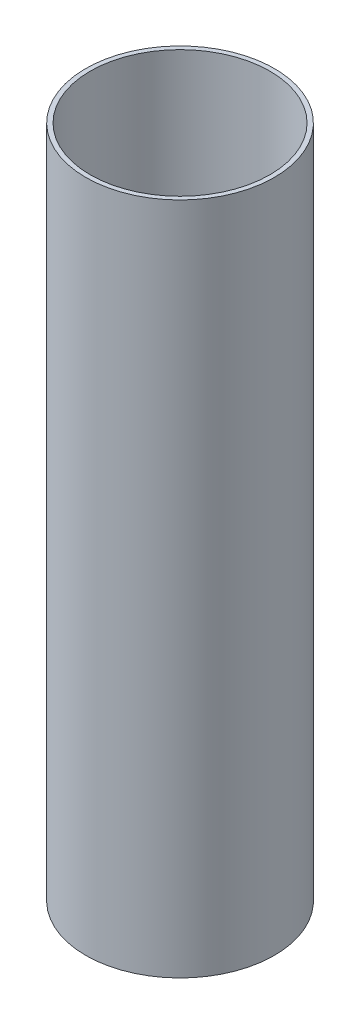
ISO-10303-21;
HEADER;
FILE_DESCRIPTION(('STEP AP214'),'2;1');
FILE_NAME('part.step','',(''),(''),'','','');
FILE_SCHEMA(('AUTOMOTIVE_DESIGN { 1 0 10303 214 1 1 1 1 }'));
ENDSEC;
DATA;
#1=APPLICATION_CONTEXT('core data for automotive mechanical design processes');
#2=APPLICATION_PROTOCOL_DEFINITION('international standard','automotive_design',2000,#1);
#3=PRODUCT_CONTEXT('',#1,'mechanical');
#4=PRODUCT('Part','Part','',(#3));
#5=PRODUCT_RELATED_PRODUCT_CATEGORY('part','',(#4));
#6=PRODUCT_DEFINITION_FORMATION('','',#4);
#7=PRODUCT_DEFINITION_CONTEXT('part definition',#1,'design');
#8=PRODUCT_DEFINITION('design','',#6,#7);
#9=PRODUCT_DEFINITION_SHAPE('','',#8);
#10=(LENGTH_UNIT() NAMED_UNIT(*) SI_UNIT(.MILLI.,.METRE.));
#11=(NAMED_UNIT(*) PLANE_ANGLE_UNIT() SI_UNIT($,.RADIAN.));
#12=(NAMED_UNIT(*) SI_UNIT($,.STERADIAN.) SOLID_ANGLE_UNIT());
#13=UNCERTAINTY_MEASURE_WITH_UNIT(LENGTH_MEASURE(1.E-05),#10,'distance_accuracy_value','');
#14=(GEOMETRIC_REPRESENTATION_CONTEXT(3) GLOBAL_UNCERTAINTY_ASSIGNED_CONTEXT((#13)) GLOBAL_UNIT_ASSIGNED_CONTEXT((#10,
#11,#12)) REPRESENTATION_CONTEXT('',''));
#15=CARTESIAN_POINT('',(0.,0.,0.));
#16=DIRECTION('',(0.,0.,1.));
#17=DIRECTION('',(1.,0.,0.));
#18=AXIS2_PLACEMENT_3D('',#15,#16,#17);
#19=CARTESIAN_POINT('',(0.,285.75,0.));
#20=DIRECTION('',(0.,1.,0.));
#21=DIRECTION('',(0.,0.,1.));
#22=AXIS2_PLACEMENT_3D('',#19,#20,#21);
#23=PLANE('',#22);
#24=CARTESIAN_POINT('',(0.,285.75,0.));
#25=DIRECTION('',(0.,1.,0.));
#26=DIRECTION('',(0.,0.,1.));
#27=AXIS2_PLACEMENT_3D('',#24,#25,#26);
#28=CIRCLE('',#27,40.005);
#29=CARTESIAN_POINT('',(0.,285.75,40.005));
#30=VERTEX_POINT('',#29);
#31=EDGE_CURVE('E10',#30,#30,#28,.T.);
#32=ORIENTED_EDGE('',*,*,#31,.T.);
#33=EDGE_LOOP('',(#32));
#34=FACE_BOUND('',#33,.T.);
#35=CARTESIAN_POINT('',(0.,285.75,0.));
#36=DIRECTION('',(0.,1.,0.));
#37=DIRECTION('',(0.,0.,1.));
#38=AXIS2_PLACEMENT_3D('',#35,#36,#37);
#39=CIRCLE('',#38,38.1);
#40=CARTESIAN_POINT('',(0.,285.75,38.1));
#41=VERTEX_POINT('',#40);
#42=EDGE_CURVE('E42',#41,#41,#39,.T.);
#43=ORIENTED_EDGE('',*,*,#42,.F.);
#44=EDGE_LOOP('',(#43));
#45=FACE_BOUND('',#44,.T.);
#46=ADVANCED_FACE('F31',(#34,#45),#23,.T.);
#47=CARTESIAN_POINT('',(0.,0.,0.));
#48=DIRECTION('',(0.,1.,0.));
#49=DIRECTION('',(0.,0.,1.));
#50=AXIS2_PLACEMENT_3D('',#47,#48,#49);
#51=PLANE('',#50);
#52=CARTESIAN_POINT('',(0.,0.,0.));
#53=DIRECTION('',(0.,1.,0.));
#54=DIRECTION('',(0.,0.,1.));
#55=AXIS2_PLACEMENT_3D('',#52,#53,#54);
#56=CIRCLE('',#55,40.005);
#57=CARTESIAN_POINT('',(0.,0.,40.005));
#58=VERTEX_POINT('',#57);
#59=EDGE_CURVE('E35',#58,#58,#56,.T.);
#60=ORIENTED_EDGE('',*,*,#59,.F.);
#61=EDGE_LOOP('',(#60));
#62=FACE_BOUND('',#61,.T.);
#63=CARTESIAN_POINT('',(0.,0.,0.));
#64=DIRECTION('',(0.,1.,0.));
#65=DIRECTION('',(0.,0.,1.));
#66=AXIS2_PLACEMENT_3D('',#63,#64,#65);
#67=CIRCLE('',#66,38.1);
#68=CARTESIAN_POINT('',(0.,0.,38.1));
#69=VERTEX_POINT('',#68);
#70=EDGE_CURVE('E44',#69,#69,#67,.T.);
#71=ORIENTED_EDGE('',*,*,#70,.T.);
#72=EDGE_LOOP('',(#71));
#73=FACE_BOUND('',#72,.T.);
#74=ADVANCED_FACE('F54',(#62,#73),#51,.F.);
#75=CARTESIAN_POINT('',(0.,285.75,0.));
#76=DIRECTION('',(0.,-1.,0.));
#77=DIRECTION('',(0.,0.,-1.));
#78=AXIS2_PLACEMENT_3D('',#75,#76,#77);
#79=CYLINDRICAL_SURFACE('',#78,40.005);
#80=ORIENTED_EDGE('',*,*,#31,.F.);
#81=EDGE_LOOP('',(#80));
#82=FACE_BOUND('',#81,.T.);
#83=ORIENTED_EDGE('',*,*,#59,.T.);
#84=EDGE_LOOP('',(#83));
#85=FACE_BOUND('',#84,.T.);
#86=ADVANCED_FACE('F33',(#82,#85),#79,.T.);
#87=CARTESIAN_POINT('',(0.,285.75,0.));
#88=DIRECTION('',(0.,-1.,0.));
#89=DIRECTION('',(0.,0.,-1.));
#90=AXIS2_PLACEMENT_3D('',#87,#88,#89);
#91=CYLINDRICAL_SURFACE('',#90,38.1);
#92=ORIENTED_EDGE('',*,*,#42,.T.);
#93=EDGE_LOOP('',(#92));
#94=FACE_BOUND('',#93,.T.);
#95=ORIENTED_EDGE('',*,*,#70,.F.);
#96=EDGE_LOOP('',(#95));
#97=FACE_BOUND('',#96,.T.);
#98=ADVANCED_FACE('F50',(#94,#97),#91,.F.);
#99=CLOSED_SHELL('',(#46,#74,#86,#98));
#100=MANIFOLD_SOLID_BREP('B2',#99);
#101=ADVANCED_BREP_SHAPE_REPRESENTATION('',(#18,#100),#14);
#102=SHAPE_DEFINITION_REPRESENTATION(#9,#101);
ENDSEC;
END-ISO-10303-21;
